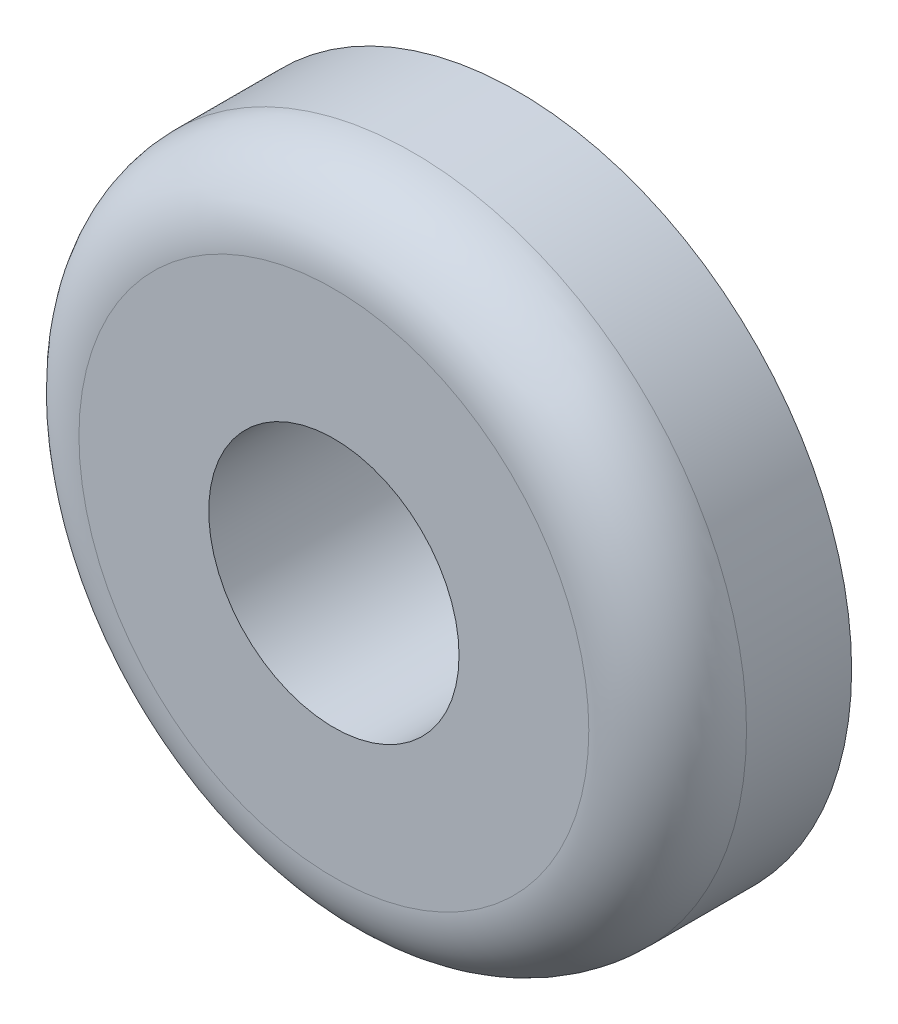
ISO-10303-21;
HEADER;
FILE_DESCRIPTION(('STEP AP214'),'2;1');
FILE_NAME('part.step','',(''),(''),'','','');
FILE_SCHEMA(('AUTOMOTIVE_DESIGN { 1 0 10303 214 1 1 1 1 }'));
ENDSEC;
DATA;
#1=APPLICATION_CONTEXT('core data for automotive mechanical design processes');
#2=APPLICATION_PROTOCOL_DEFINITION('international standard','automotive_design',2000,#1);
#3=PRODUCT_CONTEXT('',#1,'mechanical');
#4=PRODUCT('Part','Part','',(#3));
#5=PRODUCT_RELATED_PRODUCT_CATEGORY('part','',(#4));
#6=PRODUCT_DEFINITION_FORMATION('','',#4);
#7=PRODUCT_DEFINITION_CONTEXT('part definition',#1,'design');
#8=PRODUCT_DEFINITION('design','',#6,#7);
#9=PRODUCT_DEFINITION_SHAPE('','',#8);
#10=(LENGTH_UNIT() NAMED_UNIT(*) SI_UNIT(.MILLI.,.METRE.));
#11=(NAMED_UNIT(*) PLANE_ANGLE_UNIT() SI_UNIT($,.RADIAN.));
#12=(NAMED_UNIT(*) SI_UNIT($,.STERADIAN.) SOLID_ANGLE_UNIT());
#13=UNCERTAINTY_MEASURE_WITH_UNIT(LENGTH_MEASURE(1.E-05),#10,'distance_accuracy_value','');
#14=(GEOMETRIC_REPRESENTATION_CONTEXT(3) GLOBAL_UNCERTAINTY_ASSIGNED_CONTEXT((#13)) GLOBAL_UNIT_ASSIGNED_CONTEXT((#10,
#11,#12)) REPRESENTATION_CONTEXT('',''));
#15=CARTESIAN_POINT('',(0.,0.,0.));
#16=DIRECTION('',(0.,0.,1.));
#17=DIRECTION('',(1.,0.,0.));
#18=AXIS2_PLACEMENT_3D('',#15,#16,#17);
#19=CARTESIAN_POINT('',(0.,0.,3.5));
#20=DIRECTION('',(0.,0.,1.));
#21=DIRECTION('',(1.,0.,0.));
#22=AXIS2_PLACEMENT_3D('',#19,#20,#21);
#23=PLANE('',#22);
#24=CARTESIAN_POINT('',(0.,0.,3.5));
#25=DIRECTION('',(0.,0.,1.));
#26=DIRECTION('',(1.,0.,0.));
#27=AXIS2_PLACEMENT_3D('',#24,#25,#26);
#28=CIRCLE('',#27,4.85);
#29=CARTESIAN_POINT('',(4.85,0.,3.5));
#30=VERTEX_POINT('',#29);
#31=EDGE_CURVE('E38',#30,#30,#28,.T.);
#32=ORIENTED_EDGE('',*,*,#31,.T.);
#33=EDGE_LOOP('',(#32));
#34=FACE_BOUND('',#33,.T.);
#35=CARTESIAN_POINT('',(0.,0.,3.5));
#36=DIRECTION('',(0.,0.,1.));
#37=DIRECTION('',(1.,0.,0.));
#38=AXIS2_PLACEMENT_3D('',#35,#36,#37);
#39=CIRCLE('',#38,2.38125);
#40=CARTESIAN_POINT('',(2.38125,0.,3.5));
#41=VERTEX_POINT('',#40);
#42=EDGE_CURVE('E46',#41,#41,#39,.T.);
#43=ORIENTED_EDGE('',*,*,#42,.F.);
#44=EDGE_LOOP('',(#43));
#45=FACE_BOUND('',#44,.T.);
#46=ADVANCED_FACE('F31',(#34,#45),#23,.T.);
#47=CARTESIAN_POINT('',(0.,0.,0.));
#48=DIRECTION('',(0.,0.,1.));
#49=DIRECTION('',(1.,0.,0.));
#50=AXIS2_PLACEMENT_3D('',#47,#48,#49);
#51=PLANE('',#50);
#52=CARTESIAN_POINT('',(0.,0.,0.));
#53=DIRECTION('',(0.,0.,1.));
#54=DIRECTION('',(1.,0.,0.));
#55=AXIS2_PLACEMENT_3D('',#52,#53,#54);
#56=CIRCLE('',#55,6.35);
#57=CARTESIAN_POINT('',(6.35,0.,0.));
#58=VERTEX_POINT('',#57);
#59=EDGE_CURVE('E42',#58,#58,#56,.T.);
#60=ORIENTED_EDGE('',*,*,#59,.F.);
#61=EDGE_LOOP('',(#60));
#62=FACE_BOUND('',#61,.T.);
#63=CARTESIAN_POINT('',(0.,0.,0.));
#64=DIRECTION('',(0.,0.,1.));
#65=DIRECTION('',(1.,0.,0.));
#66=AXIS2_PLACEMENT_3D('',#63,#64,#65);
#67=CIRCLE('',#66,2.38125);
#68=CARTESIAN_POINT('',(2.38125,0.,0.));
#69=VERTEX_POINT('',#68);
#70=EDGE_CURVE('E49',#69,#69,#67,.T.);
#71=ORIENTED_EDGE('',*,*,#70,.T.);
#72=EDGE_LOOP('',(#71));
#73=FACE_BOUND('',#72,.T.);
#74=ADVANCED_FACE('F59',(#62,#73),#51,.F.);
#75=CARTESIAN_POINT('',(0.,0.,3.5));
#76=DIRECTION('',(0.,0.,-1.));
#77=DIRECTION('',(-1.,0.,0.));
#78=AXIS2_PLACEMENT_3D('',#75,#76,#77);
#79=CYLINDRICAL_SURFACE('',#78,6.35);
#80=CARTESIAN_POINT('',(0.,0.,2.));
#81=DIRECTION('',(0.,0.,1.));
#82=DIRECTION('',(1.,0.,0.));
#83=AXIS2_PLACEMENT_3D('',#80,#81,#82);
#84=CIRCLE('',#83,6.35);
#85=CARTESIAN_POINT('',(6.35,0.,2.));
#86=VERTEX_POINT('',#85);
#87=EDGE_CURVE('E10',#86,#86,#84,.F.);
#88=ORIENTED_EDGE('',*,*,#87,.T.);
#89=EDGE_LOOP('',(#88));
#90=FACE_BOUND('',#89,.T.);
#91=ORIENTED_EDGE('',*,*,#59,.T.);
#92=EDGE_LOOP('',(#91));
#93=FACE_BOUND('',#92,.T.);
#94=ADVANCED_FACE('F64',(#90,#93),#79,.T.);
#95=CARTESIAN_POINT('',(0.,0.,3.5));
#96=DIRECTION('',(0.,0.,-1.));
#97=DIRECTION('',(-1.,0.,0.));
#98=AXIS2_PLACEMENT_3D('',#95,#96,#97);
#99=CYLINDRICAL_SURFACE('',#98,2.38125);
#100=ORIENTED_EDGE('',*,*,#42,.T.);
#101=EDGE_LOOP('',(#100));
#102=FACE_BOUND('',#101,.T.);
#103=ORIENTED_EDGE('',*,*,#70,.F.);
#104=EDGE_LOOP('',(#103));
#105=FACE_BOUND('',#104,.T.);
#106=ADVANCED_FACE('F55',(#102,#105),#99,.F.);
#107=CARTESIAN_POINT('',(0.,0.,2.));
#108=DIRECTION('',(0.,0.,1.));
#109=DIRECTION('',(1.,0.,0.));
#110=AXIS2_PLACEMENT_3D('',#107,#108,#109);
#111=TOROIDAL_SURFACE('',#110,4.85,1.5);
#112=ORIENTED_EDGE('',*,*,#87,.F.);
#113=EDGE_LOOP('',(#112));
#114=FACE_BOUND('',#113,.T.);
#115=ORIENTED_EDGE('',*,*,#31,.F.);
#116=EDGE_LOOP('',(#115));
#117=FACE_BOUND('',#116,.T.);
#118=ADVANCED_FACE('F33',(#114,#117),#111,.T.);
#119=CLOSED_SHELL('',(#46,#74,#94,#106,#118));
#120=MANIFOLD_SOLID_BREP('B2',#119);
#121=ADVANCED_BREP_SHAPE_REPRESENTATION('',(#18,#120),#14);
#122=SHAPE_DEFINITION_REPRESENTATION(#9,#121);
ENDSEC;
END-ISO-10303-21;
